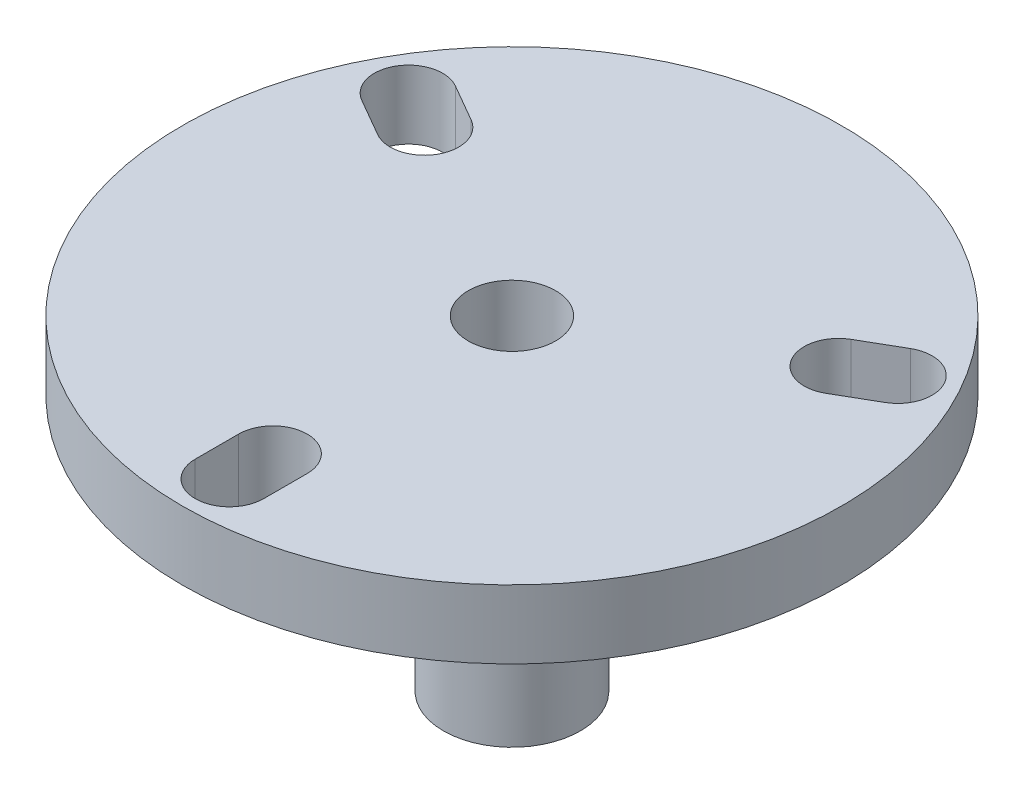
ISO-10303-21;
HEADER;
FILE_DESCRIPTION(('STEP AP214'),'2;1');
FILE_NAME('part.step','',(''),(''),'','','');
FILE_SCHEMA(('AUTOMOTIVE_DESIGN { 1 0 10303 214 1 1 1 1 }'));
ENDSEC;
DATA;
#1=APPLICATION_CONTEXT('core data for automotive mechanical design processes');
#2=APPLICATION_PROTOCOL_DEFINITION('international standard','automotive_design',2000,#1);
#3=PRODUCT_CONTEXT('',#1,'mechanical');
#4=PRODUCT('Part','Part','',(#3));
#5=PRODUCT_RELATED_PRODUCT_CATEGORY('part','',(#4));
#6=PRODUCT_DEFINITION_FORMATION('','',#4);
#7=PRODUCT_DEFINITION_CONTEXT('part definition',#1,'design');
#8=PRODUCT_DEFINITION('design','',#6,#7);
#9=PRODUCT_DEFINITION_SHAPE('','',#8);
#10=(LENGTH_UNIT() NAMED_UNIT(*) SI_UNIT(.MILLI.,.METRE.));
#11=(NAMED_UNIT(*) PLANE_ANGLE_UNIT() SI_UNIT($,.RADIAN.));
#12=(NAMED_UNIT(*) SI_UNIT($,.STERADIAN.) SOLID_ANGLE_UNIT());
#13=UNCERTAINTY_MEASURE_WITH_UNIT(LENGTH_MEASURE(1.E-05),#10,'distance_accuracy_value','');
#14=(GEOMETRIC_REPRESENTATION_CONTEXT(3) GLOBAL_UNCERTAINTY_ASSIGNED_CONTEXT((#13)) GLOBAL_UNIT_ASSIGNED_CONTEXT((#10,
#11,#12)) REPRESENTATION_CONTEXT('',''));
#15=CARTESIAN_POINT('',(0.,0.,0.));
#16=DIRECTION('',(0.,0.,1.));
#17=DIRECTION('',(1.,0.,0.));
#18=AXIS2_PLACEMENT_3D('',#15,#16,#17);
#19=CARTESIAN_POINT('',(0.,-4.,13.96));
#20=DIRECTION('',(0.,1.,0.));
#21=DIRECTION('',(0.,0.,1.));
#22=AXIS2_PLACEMENT_3D('',#19,#20,#21);
#23=CYLINDRICAL_SURFACE('',#22,2.);
#24=CARTESIAN_POINT('',(0.,0.,13.96));
#25=DIRECTION('',(0.,1.,0.));
#26=DIRECTION('',(0.,0.,1.));
#27=AXIS2_PLACEMENT_3D('',#24,#25,#26);
#28=CIRCLE('',#27,2.);
#29=CARTESIAN_POINT('',(2.,0.,13.96));
#30=VERTEX_POINT('',#29);
#31=CARTESIAN_POINT('',(-2.,0.,13.96));
#32=VERTEX_POINT('',#31);
#33=EDGE_CURVE('E180',#30,#32,#28,.T.);
#34=ORIENTED_EDGE('',*,*,#33,.T.);
#35=DIRECTION('',(0.,1.,0.));
#36=VECTOR('',#35,1.);
#37=CARTESIAN_POINT('',(-2.,-4.,13.96));
#38=LINE('',#37,#36);
#39=CARTESIAN_POINT('',(-2.,-4.,13.96));
#40=VERTEX_POINT('',#39);
#41=EDGE_CURVE('E11',#40,#32,#38,.T.);
#42=ORIENTED_EDGE('',*,*,#41,.F.);
#43=CARTESIAN_POINT('',(0.,-4.,13.96));
#44=DIRECTION('',(0.,1.,0.));
#45=DIRECTION('',(0.,0.,1.));
#46=AXIS2_PLACEMENT_3D('',#43,#44,#45);
#47=CIRCLE('',#46,2.);
#48=CARTESIAN_POINT('',(2.,-4.,13.96));
#49=VERTEX_POINT('',#48);
#50=EDGE_CURVE('E54',#49,#40,#47,.T.);
#51=ORIENTED_EDGE('',*,*,#50,.F.);
#52=DIRECTION('',(0.,1.,0.));
#53=VECTOR('',#52,1.);
#54=CARTESIAN_POINT('',(2.,-4.,13.96));
#55=LINE('',#54,#53);
#56=EDGE_CURVE('E146',#49,#30,#55,.T.);
#57=ORIENTED_EDGE('',*,*,#56,.T.);
#58=EDGE_LOOP('',(#34,#42,#51,#57));
#59=FACE_BOUND('',#58,.T.);
#60=ADVANCED_FACE('F35',(#59),#23,.F.);
#61=CARTESIAN_POINT('',(-1.99999999999999,-4.,0.));
#62=DIRECTION('',(1.,0.,0.));
#63=DIRECTION('',(0.,0.,-1.));
#64=AXIS2_PLACEMENT_3D('',#61,#62,#63);
#65=PLANE('',#64);
#66=DIRECTION('',(0.,0.,-1.));
#67=VECTOR('',#66,1.);
#68=CARTESIAN_POINT('',(-1.99999999999999,0.,0.));
#69=LINE('',#68,#67);
#70=CARTESIAN_POINT('',(-2.,0.,16.5));
#71=VERTEX_POINT('',#70);
#72=EDGE_CURVE('E185',#71,#32,#69,.T.);
#73=ORIENTED_EDGE('',*,*,#72,.F.);
#74=DIRECTION('',(0.,1.,0.));
#75=VECTOR('',#74,1.);
#76=CARTESIAN_POINT('',(-2.,-4.,16.5));
#77=LINE('',#76,#75);
#78=CARTESIAN_POINT('',(-2.,-4.,16.5));
#79=VERTEX_POINT('',#78);
#80=EDGE_CURVE('E45',#79,#71,#77,.T.);
#81=ORIENTED_EDGE('',*,*,#80,.F.);
#82=DIRECTION('',(0.,0.,-1.));
#83=VECTOR('',#82,1.);
#84=CARTESIAN_POINT('',(-1.99999999999999,-4.,0.));
#85=LINE('',#84,#83);
#86=EDGE_CURVE('E138',#79,#40,#85,.T.);
#87=ORIENTED_EDGE('',*,*,#86,.T.);
#88=ORIENTED_EDGE('',*,*,#41,.T.);
#89=EDGE_LOOP('',(#73,#81,#87,#88));
#90=FACE_BOUND('',#89,.T.);
#91=ADVANCED_FACE('F285',(#90),#65,.T.);
#92=CARTESIAN_POINT('',(0.,-4.,16.5));
#93=DIRECTION('',(0.,1.,0.));
#94=DIRECTION('',(0.,0.,1.));
#95=AXIS2_PLACEMENT_3D('',#92,#93,#94);
#96=CYLINDRICAL_SURFACE('',#95,2.);
#97=CARTESIAN_POINT('',(0.,0.,16.5));
#98=DIRECTION('',(0.,1.,0.));
#99=DIRECTION('',(0.,0.,1.));
#100=AXIS2_PLACEMENT_3D('',#97,#98,#99);
#101=CIRCLE('',#100,2.);
#102=CARTESIAN_POINT('',(2.,0.,16.5));
#103=VERTEX_POINT('',#102);
#104=EDGE_CURVE('E143',#71,#103,#101,.T.);
#105=ORIENTED_EDGE('',*,*,#104,.T.);
#106=DIRECTION('',(0.,1.,0.));
#107=VECTOR('',#106,1.);
#108=CARTESIAN_POINT('',(2.,-4.,16.5));
#109=LINE('',#108,#107);
#110=CARTESIAN_POINT('',(2.,-4.,16.5));
#111=VERTEX_POINT('',#110);
#112=EDGE_CURVE('E141',#111,#103,#109,.T.);
#113=ORIENTED_EDGE('',*,*,#112,.F.);
#114=CARTESIAN_POINT('',(0.,-4.,16.5));
#115=DIRECTION('',(0.,1.,0.));
#116=DIRECTION('',(0.,0.,1.));
#117=AXIS2_PLACEMENT_3D('',#114,#115,#116);
#118=CIRCLE('',#117,2.);
#119=EDGE_CURVE('E131',#79,#111,#118,.T.);
#120=ORIENTED_EDGE('',*,*,#119,.F.);
#121=ORIENTED_EDGE('',*,*,#80,.T.);
#122=EDGE_LOOP('',(#105,#113,#120,#121));
#123=FACE_BOUND('',#122,.T.);
#124=ADVANCED_FACE('F142',(#123),#96,.F.);
#125=CARTESIAN_POINT('',(0.999999999999998,-4.,1.73205080756888));
#126=DIRECTION('',(0.499999999999998,0.,0.86602540378444));
#127=DIRECTION('',(0.86602540378444,0.,-0.499999999999998));
#128=AXIS2_PLACEMENT_3D('',#125,#126,#127);
#129=PLANE('',#128);
#130=DIRECTION('',(0.86602540378444,0.,-0.499999999999998));
#131=VECTOR('',#130,1.);
#132=CARTESIAN_POINT('',(0.999999999999998,0.,1.73205080756888));
#133=LINE('',#132,#131);
#134=CARTESIAN_POINT('',(13.0897146368308,0.,-5.24794919243109));
#135=VERTEX_POINT('',#134);
#136=CARTESIAN_POINT('',(15.2894191624433,0.,-6.51794919243109));
#137=VERTEX_POINT('',#136);
#138=EDGE_CURVE('E171',#135,#137,#133,.T.);
#139=ORIENTED_EDGE('',*,*,#138,.T.);
#140=DIRECTION('',(0.,1.,0.));
#141=VECTOR('',#140,1.);
#142=CARTESIAN_POINT('',(15.2894191624433,-4.,-6.51794919243109));
#143=LINE('',#142,#141);
#144=CARTESIAN_POINT('',(15.2894191624433,-4.,-6.51794919243109));
#145=VERTEX_POINT('',#144);
#146=EDGE_CURVE('E194',#145,#137,#143,.T.);
#147=ORIENTED_EDGE('',*,*,#146,.F.);
#148=DIRECTION('',(0.86602540378444,0.,-0.499999999999998));
#149=VECTOR('',#148,1.);
#150=CARTESIAN_POINT('',(0.999999999999998,-4.,1.73205080756888));
#151=LINE('',#150,#149);
#152=CARTESIAN_POINT('',(13.0897146368308,-4.,-5.24794919243109));
#153=VERTEX_POINT('',#152);
#154=EDGE_CURVE('E235',#153,#145,#151,.T.);
#155=ORIENTED_EDGE('',*,*,#154,.F.);
#156=DIRECTION('',(0.,1.,0.));
#157=VECTOR('',#156,1.);
#158=CARTESIAN_POINT('',(13.0897146368308,-4.,-5.24794919243109));
#159=LINE('',#158,#157);
#160=EDGE_CURVE('E203',#153,#135,#159,.T.);
#161=ORIENTED_EDGE('',*,*,#160,.T.);
#162=EDGE_LOOP('',(#139,#147,#155,#161));
#163=FACE_BOUND('',#162,.T.);
#164=ADVANCED_FACE('F263',(#163),#129,.F.);
#165=CARTESIAN_POINT('',(14.2894191624433,-4.,-8.24999999999997));
#166=DIRECTION('',(0.,1.,0.));
#167=DIRECTION('',(0.,0.,1.));
#168=AXIS2_PLACEMENT_3D('',#165,#166,#167);
#169=CYLINDRICAL_SURFACE('',#168,2.);
#170=CARTESIAN_POINT('',(14.2894191624433,0.,-8.24999999999997));
#171=DIRECTION('',(0.,1.,0.));
#172=DIRECTION('',(0.,0.,1.));
#173=AXIS2_PLACEMENT_3D('',#170,#171,#172);
#174=CIRCLE('',#173,2.);
#175=CARTESIAN_POINT('',(13.2894191624433,0.,-9.98205080756885));
#176=VERTEX_POINT('',#175);
#177=EDGE_CURVE('E178',#137,#176,#174,.T.);
#178=ORIENTED_EDGE('',*,*,#177,.T.);
#179=DIRECTION('',(0.,1.,0.));
#180=VECTOR('',#179,1.);
#181=CARTESIAN_POINT('',(13.2894191624433,-4.,-9.98205080756885));
#182=LINE('',#181,#180);
#183=CARTESIAN_POINT('',(13.2894191624433,-4.,-9.98205080756885));
#184=VERTEX_POINT('',#183);
#185=EDGE_CURVE('E197',#184,#176,#182,.T.);
#186=ORIENTED_EDGE('',*,*,#185,.F.);
#187=CARTESIAN_POINT('',(14.2894191624433,-4.,-8.24999999999997));
#188=DIRECTION('',(0.,1.,0.));
#189=DIRECTION('',(0.,0.,1.));
#190=AXIS2_PLACEMENT_3D('',#187,#188,#189);
#191=CIRCLE('',#190,2.);
#192=EDGE_CURVE('E151',#145,#184,#191,.T.);
#193=ORIENTED_EDGE('',*,*,#192,.F.);
#194=ORIENTED_EDGE('',*,*,#146,.T.);
#195=EDGE_LOOP('',(#178,#186,#193,#194));
#196=FACE_BOUND('',#195,.T.);
#197=ADVANCED_FACE('F252',(#196),#169,.F.);
#198=CARTESIAN_POINT('',(-0.999999999999994,-4.,-1.73205080756887));
#199=DIRECTION('',(-0.499999999999998,0.,-0.86602540378444));
#200=DIRECTION('',(-0.86602540378444,0.,0.499999999999998));
#201=AXIS2_PLACEMENT_3D('',#198,#199,#200);
#202=PLANE('',#201);
#203=DIRECTION('',(-0.86602540378444,0.,0.499999999999998));
#204=VECTOR('',#203,1.);
#205=CARTESIAN_POINT('',(-0.999999999999994,0.,-1.73205080756887));
#206=LINE('',#205,#204);
#207=CARTESIAN_POINT('',(11.0897146368308,0.,-8.71205080756885));
#208=VERTEX_POINT('',#207);
#209=EDGE_CURVE('E176',#176,#208,#206,.T.);
#210=ORIENTED_EDGE('',*,*,#209,.T.);
#211=DIRECTION('',(0.,1.,0.));
#212=VECTOR('',#211,1.);
#213=CARTESIAN_POINT('',(11.0897146368308,-4.,-8.71205080756885));
#214=LINE('',#213,#212);
#215=CARTESIAN_POINT('',(11.0897146368308,-4.,-8.71205080756885));
#216=VERTEX_POINT('',#215);
#217=EDGE_CURVE('E200',#216,#208,#214,.T.);
#218=ORIENTED_EDGE('',*,*,#217,.F.);
#219=DIRECTION('',(-0.86602540378444,0.,0.499999999999998));
#220=VECTOR('',#219,1.);
#221=CARTESIAN_POINT('',(-0.999999999999994,-4.,-1.73205080756887));
#222=LINE('',#221,#220);
#223=EDGE_CURVE('E244',#184,#216,#222,.T.);
#224=ORIENTED_EDGE('',*,*,#223,.F.);
#225=ORIENTED_EDGE('',*,*,#185,.T.);
#226=EDGE_LOOP('',(#210,#218,#224,#225));
#227=FACE_BOUND('',#226,.T.);
#228=ADVANCED_FACE('F255',(#227),#202,.F.);
#229=CARTESIAN_POINT('',(0.999999999999991,-4.,-1.73205080756887));
#230=DIRECTION('',(-0.499999999999998,0.,0.86602540378444));
#231=DIRECTION('',(0.86602540378444,0.,0.499999999999998));
#232=AXIS2_PLACEMENT_3D('',#229,#230,#231);
#233=PLANE('',#232);
#234=DIRECTION('',(0.86602540378444,0.,0.499999999999998));
#235=VECTOR('',#234,1.);
#236=CARTESIAN_POINT('',(0.999999999999991,0.,-1.73205080756887));
#237=LINE('',#236,#235);
#238=CARTESIAN_POINT('',(-13.2894191624433,0.,-9.98205080756884));
#239=VERTEX_POINT('',#238);
#240=CARTESIAN_POINT('',(-11.0897146368308,0.,-8.71205080756885));
#241=VERTEX_POINT('',#240);
#242=EDGE_CURVE('E160',#239,#241,#237,.T.);
#243=ORIENTED_EDGE('',*,*,#242,.F.);
#244=DIRECTION('',(0.,1.,0.));
#245=VECTOR('',#244,1.);
#246=CARTESIAN_POINT('',(-13.2894191624433,-4.,-9.98205080756884));
#247=LINE('',#246,#245);
#248=CARTESIAN_POINT('',(-13.2894191624433,-4.,-9.98205080756884));
#249=VERTEX_POINT('',#248);
#250=EDGE_CURVE('E206',#249,#239,#247,.T.);
#251=ORIENTED_EDGE('',*,*,#250,.F.);
#252=DIRECTION('',(0.86602540378444,0.,0.499999999999998));
#253=VECTOR('',#252,1.);
#254=CARTESIAN_POINT('',(0.999999999999991,-4.,-1.73205080756887));
#255=LINE('',#254,#253);
#256=CARTESIAN_POINT('',(-11.0897146368308,-4.,-8.71205080756885));
#257=VERTEX_POINT('',#256);
#258=EDGE_CURVE('E190',#249,#257,#255,.T.);
#259=ORIENTED_EDGE('',*,*,#258,.T.);
#260=DIRECTION('',(0.,1.,0.));
#261=VECTOR('',#260,1.);
#262=CARTESIAN_POINT('',(-11.0897146368308,-4.,-8.71205080756885));
#263=LINE('',#262,#261);
#264=EDGE_CURVE('E159',#257,#241,#263,.T.);
#265=ORIENTED_EDGE('',*,*,#264,.T.);
#266=EDGE_LOOP('',(#243,#251,#259,#265));
#267=FACE_BOUND('',#266,.T.);
#268=ADVANCED_FACE('F37',(#267),#233,.T.);
#269=CARTESIAN_POINT('',(-14.2894191624433,-4.,-8.24999999999996));
#270=DIRECTION('',(0.,1.,0.));
#271=DIRECTION('',(0.,0.,1.));
#272=AXIS2_PLACEMENT_3D('',#269,#270,#271);
#273=CYLINDRICAL_SURFACE('',#272,2.00000000000001);
#274=CARTESIAN_POINT('',(-14.2894191624433,0.,-8.24999999999996));
#275=DIRECTION('',(0.,1.,0.));
#276=DIRECTION('',(0.,0.,1.));
#277=AXIS2_PLACEMENT_3D('',#274,#275,#276);
#278=CIRCLE('',#277,2.00000000000001);
#279=CARTESIAN_POINT('',(-15.2894191624433,0.,-6.51794919243108));
#280=VERTEX_POINT('',#279);
#281=EDGE_CURVE('E169',#239,#280,#278,.T.);
#282=ORIENTED_EDGE('',*,*,#281,.T.);
#283=DIRECTION('',(0.,1.,0.));
#284=VECTOR('',#283,1.);
#285=CARTESIAN_POINT('',(-15.2894191624433,-4.,-6.51794919243108));
#286=LINE('',#285,#284);
#287=CARTESIAN_POINT('',(-15.2894191624433,-4.,-6.51794919243108));
#288=VERTEX_POINT('',#287);
#289=EDGE_CURVE('E208',#288,#280,#286,.T.);
#290=ORIENTED_EDGE('',*,*,#289,.F.);
#291=CARTESIAN_POINT('',(-14.2894191624433,-4.,-8.24999999999996));
#292=DIRECTION('',(0.,1.,0.));
#293=DIRECTION('',(0.,0.,1.));
#294=AXIS2_PLACEMENT_3D('',#291,#292,#293);
#295=CIRCLE('',#294,2.00000000000001);
#296=EDGE_CURVE('E233',#249,#288,#295,.T.);
#297=ORIENTED_EDGE('',*,*,#296,.F.);
#298=ORIENTED_EDGE('',*,*,#250,.T.);
#299=EDGE_LOOP('',(#282,#290,#297,#298));
#300=FACE_BOUND('',#299,.T.);
#301=ADVANCED_FACE('F227',(#300),#273,.F.);
#302=CARTESIAN_POINT('',(-0.999999999999999,-4.,1.73205080756888));
#303=DIRECTION('',(-0.499999999999998,0.,0.86602540378444));
#304=DIRECTION('',(0.86602540378444,0.,0.499999999999998));
#305=AXIS2_PLACEMENT_3D('',#302,#303,#304);
#306=PLANE('',#305);
#307=DIRECTION('',(0.86602540378444,0.,0.499999999999998));
#308=VECTOR('',#307,1.);
#309=CARTESIAN_POINT('',(-0.999999999999999,0.,1.73205080756888));
#310=LINE('',#309,#308);
#311=CARTESIAN_POINT('',(-13.0897146368308,0.,-5.24794919243109));
#312=VERTEX_POINT('',#311);
#313=EDGE_CURVE('E167',#280,#312,#310,.T.);
#314=ORIENTED_EDGE('',*,*,#313,.T.);
#315=DIRECTION('',(0.,1.,0.));
#316=VECTOR('',#315,1.);
#317=CARTESIAN_POINT('',(-13.0897146368308,-4.,-5.24794919243109));
#318=LINE('',#317,#316);
#319=CARTESIAN_POINT('',(-13.0897146368308,-4.,-5.24794919243109));
#320=VERTEX_POINT('',#319);
#321=EDGE_CURVE('E211',#320,#312,#318,.T.);
#322=ORIENTED_EDGE('',*,*,#321,.F.);
#323=DIRECTION('',(0.86602540378444,0.,0.499999999999998));
#324=VECTOR('',#323,1.);
#325=CARTESIAN_POINT('',(-0.999999999999999,-4.,1.73205080756888));
#326=LINE('',#325,#324);
#327=EDGE_CURVE('E232',#288,#320,#326,.T.);
#328=ORIENTED_EDGE('',*,*,#327,.F.);
#329=ORIENTED_EDGE('',*,*,#289,.T.);
#330=EDGE_LOOP('',(#314,#322,#328,#329));
#331=FACE_BOUND('',#330,.T.);
#332=ADVANCED_FACE('F231',(#331),#306,.F.);
#333=CARTESIAN_POINT('',(0.,-4.,0.));
#334=DIRECTION('',(0.,1.,0.));
#335=DIRECTION('',(0.,0.,1.));
#336=AXIS2_PLACEMENT_3D('',#333,#334,#335);
#337=CYLINDRICAL_SURFACE('',#336,19.25);
#338=CARTESIAN_POINT('',(0.,-4.,0.));
#339=DIRECTION('',(0.,1.,0.));
#340=DIRECTION('',(0.,0.,1.));
#341=AXIS2_PLACEMENT_3D('',#338,#339,#340);
#342=CIRCLE('',#341,19.25);
#343=CARTESIAN_POINT('',(0.,-4.,19.25));
#344=VERTEX_POINT('',#343);
#345=EDGE_CURVE('E156',#344,#344,#342,.T.);
#346=ORIENTED_EDGE('',*,*,#345,.T.);
#347=EDGE_LOOP('',(#346));
#348=FACE_BOUND('',#347,.T.);
#349=CARTESIAN_POINT('',(0.,0.,0.));
#350=DIRECTION('',(0.,1.,0.));
#351=DIRECTION('',(0.,0.,1.));
#352=AXIS2_PLACEMENT_3D('',#349,#350,#351);
#353=CIRCLE('',#352,19.25);
#354=CARTESIAN_POINT('',(0.,0.,19.25));
#355=VERTEX_POINT('',#354);
#356=EDGE_CURVE('E188',#355,#355,#353,.T.);
#357=ORIENTED_EDGE('',*,*,#356,.F.);
#358=EDGE_LOOP('',(#357));
#359=FACE_BOUND('',#358,.T.);
#360=ADVANCED_FACE('F273',(#348,#359),#337,.T.);
#361=CARTESIAN_POINT('',(1.99999999999999,-4.,0.));
#362=DIRECTION('',(1.,0.,0.));
#363=DIRECTION('',(0.,0.,-1.));
#364=AXIS2_PLACEMENT_3D('',#361,#362,#363);
#365=PLANE('',#364);
#366=DIRECTION('',(0.,0.,-1.));
#367=VECTOR('',#366,1.);
#368=CARTESIAN_POINT('',(1.99999999999999,0.,0.));
#369=LINE('',#368,#367);
#370=EDGE_CURVE('E182',#103,#30,#369,.T.);
#371=ORIENTED_EDGE('',*,*,#370,.T.);
#372=ORIENTED_EDGE('',*,*,#56,.F.);
#373=DIRECTION('',(0.,0.,-1.));
#374=VECTOR('',#373,1.);
#375=CARTESIAN_POINT('',(1.99999999999999,-4.,0.));
#376=LINE('',#375,#374);
#377=EDGE_CURVE('E136',#111,#49,#376,.T.);
#378=ORIENTED_EDGE('',*,*,#377,.F.);
#379=ORIENTED_EDGE('',*,*,#112,.T.);
#380=EDGE_LOOP('',(#371,#372,#378,#379));
#381=FACE_BOUND('',#380,.T.);
#382=ADVANCED_FACE('F148',(#381),#365,.F.);
#383=CARTESIAN_POINT('',(12.0897146368308,-4.,-6.97999999999997));
#384=DIRECTION('',(0.,1.,0.));
#385=DIRECTION('',(0.,0.,1.));
#386=AXIS2_PLACEMENT_3D('',#383,#384,#385);
#387=CYLINDRICAL_SURFACE('',#386,2.);
#388=CARTESIAN_POINT('',(12.0897146368308,0.,-6.97999999999997));
#389=DIRECTION('',(0.,1.,0.));
#390=DIRECTION('',(0.,0.,1.));
#391=AXIS2_PLACEMENT_3D('',#388,#389,#390);
#392=CIRCLE('',#391,2.);
#393=EDGE_CURVE('E174',#208,#135,#392,.T.);
#394=ORIENTED_EDGE('',*,*,#393,.T.);
#395=ORIENTED_EDGE('',*,*,#160,.F.);
#396=CARTESIAN_POINT('',(12.0897146368308,-4.,-6.97999999999997));
#397=DIRECTION('',(0.,1.,0.));
#398=DIRECTION('',(0.,0.,1.));
#399=AXIS2_PLACEMENT_3D('',#396,#397,#398);
#400=CIRCLE('',#399,2.);
#401=EDGE_CURVE('E242',#216,#153,#400,.T.);
#402=ORIENTED_EDGE('',*,*,#401,.F.);
#403=ORIENTED_EDGE('',*,*,#217,.T.);
#404=EDGE_LOOP('',(#394,#395,#402,#403));
#405=FACE_BOUND('',#404,.T.);
#406=ADVANCED_FACE('F260',(#405),#387,.F.);
#407=CARTESIAN_POINT('',(-12.0897146368308,-4.,-6.97999999999997));
#408=DIRECTION('',(0.,1.,0.));
#409=DIRECTION('',(0.,0.,1.));
#410=AXIS2_PLACEMENT_3D('',#407,#408,#409);
#411=CYLINDRICAL_SURFACE('',#410,2.00000000000001);
#412=CARTESIAN_POINT('',(-12.0897146368308,0.,-6.97999999999997));
#413=DIRECTION('',(0.,1.,0.));
#414=DIRECTION('',(0.,0.,1.));
#415=AXIS2_PLACEMENT_3D('',#412,#413,#414);
#416=CIRCLE('',#415,2.00000000000001);
#417=EDGE_CURVE('E163',#312,#241,#416,.T.);
#418=ORIENTED_EDGE('',*,*,#417,.T.);
#419=ORIENTED_EDGE('',*,*,#264,.F.);
#420=CARTESIAN_POINT('',(-12.0897146368308,-4.,-6.97999999999997));
#421=DIRECTION('',(0.,1.,0.));
#422=DIRECTION('',(0.,0.,1.));
#423=AXIS2_PLACEMENT_3D('',#420,#421,#422);
#424=CIRCLE('',#423,2.00000000000001);
#425=EDGE_CURVE('E107',#320,#257,#424,.T.);
#426=ORIENTED_EDGE('',*,*,#425,.F.);
#427=ORIENTED_EDGE('',*,*,#321,.T.);
#428=EDGE_LOOP('',(#418,#419,#426,#427));
#429=FACE_BOUND('',#428,.T.);
#430=ADVANCED_FACE('F218',(#429),#411,.F.);
#431=CARTESIAN_POINT('',(0.,-4.,0.));
#432=DIRECTION('',(0.,1.,0.));
#433=DIRECTION('',(0.,0.,1.));
#434=AXIS2_PLACEMENT_3D('',#431,#432,#433);
#435=PLANE('',#434);
#436=ORIENTED_EDGE('',*,*,#258,.F.);
#437=ORIENTED_EDGE('',*,*,#296,.T.);
#438=ORIENTED_EDGE('',*,*,#327,.T.);
#439=ORIENTED_EDGE('',*,*,#425,.T.);
#440=EDGE_LOOP('',(#436,#437,#438,#439));
#441=FACE_BOUND('',#440,.T.);
#442=ORIENTED_EDGE('',*,*,#154,.T.);
#443=ORIENTED_EDGE('',*,*,#192,.T.);
#444=ORIENTED_EDGE('',*,*,#223,.T.);
#445=ORIENTED_EDGE('',*,*,#401,.T.);
#446=EDGE_LOOP('',(#442,#443,#444,#445));
#447=FACE_BOUND('',#446,.T.);
#448=ORIENTED_EDGE('',*,*,#50,.T.);
#449=ORIENTED_EDGE('',*,*,#86,.F.);
#450=ORIENTED_EDGE('',*,*,#119,.T.);
#451=ORIENTED_EDGE('',*,*,#377,.T.);
#452=EDGE_LOOP('',(#448,#449,#450,#451));
#453=FACE_BOUND('',#452,.T.);
#454=ORIENTED_EDGE('',*,*,#345,.F.);
#455=EDGE_LOOP('',(#454));
#456=FACE_BOUND('',#455,.T.);
#457=CARTESIAN_POINT('',(0.,-4.,0.));
#458=DIRECTION('',(0.,1.,0.));
#459=DIRECTION('',(0.,0.,1.));
#460=AXIS2_PLACEMENT_3D('',#457,#458,#459);
#461=CIRCLE('',#460,4.);
#462=CARTESIAN_POINT('',(0.,-4.,4.));
#463=VERTEX_POINT('',#462);
#464=EDGE_CURVE('E164',#463,#463,#461,.T.);
#465=ORIENTED_EDGE('',*,*,#464,.T.);
#466=EDGE_LOOP('',(#465));
#467=FACE_BOUND('',#466,.T.);
#468=ADVANCED_FACE('F133',(#441,#447,#453,#456,#467),#435,.F.);
#469=CARTESIAN_POINT('',(0.,0.,0.));
#470=DIRECTION('',(0.,1.,0.));
#471=DIRECTION('',(0.,0.,1.));
#472=AXIS2_PLACEMENT_3D('',#469,#470,#471);
#473=PLANE('',#472);
#474=CARTESIAN_POINT('',(0.,0.,0.));
#475=DIRECTION('',(0.,1.,0.));
#476=DIRECTION('',(0.,0.,1.));
#477=AXIS2_PLACEMENT_3D('',#474,#475,#476);
#478=CIRCLE('',#477,2.55);
#479=CARTESIAN_POINT('',(0.,0.,2.55));
#480=VERTEX_POINT('',#479);
#481=EDGE_CURVE('E341',#480,#480,#478,.T.);
#482=ORIENTED_EDGE('',*,*,#481,.F.);
#483=EDGE_LOOP('',(#482));
#484=FACE_BOUND('',#483,.T.);
#485=ORIENTED_EDGE('',*,*,#242,.T.);
#486=ORIENTED_EDGE('',*,*,#417,.F.);
#487=ORIENTED_EDGE('',*,*,#313,.F.);
#488=ORIENTED_EDGE('',*,*,#281,.F.);
#489=EDGE_LOOP('',(#485,#486,#487,#488));
#490=FACE_BOUND('',#489,.T.);
#491=ORIENTED_EDGE('',*,*,#138,.F.);
#492=ORIENTED_EDGE('',*,*,#393,.F.);
#493=ORIENTED_EDGE('',*,*,#209,.F.);
#494=ORIENTED_EDGE('',*,*,#177,.F.);
#495=EDGE_LOOP('',(#491,#492,#493,#494));
#496=FACE_BOUND('',#495,.T.);
#497=ORIENTED_EDGE('',*,*,#33,.F.);
#498=ORIENTED_EDGE('',*,*,#370,.F.);
#499=ORIENTED_EDGE('',*,*,#104,.F.);
#500=ORIENTED_EDGE('',*,*,#72,.T.);
#501=EDGE_LOOP('',(#497,#498,#499,#500));
#502=FACE_BOUND('',#501,.T.);
#503=ORIENTED_EDGE('',*,*,#356,.T.);
#504=EDGE_LOOP('',(#503));
#505=FACE_BOUND('',#504,.T.);
#506=ADVANCED_FACE('F223',(#484,#490,#496,#502,#505),#473,.T.);
#507=CARTESIAN_POINT('',(0.,-19.,0.));
#508=DIRECTION('',(0.,1.,0.));
#509=DIRECTION('',(0.,0.,1.));
#510=AXIS2_PLACEMENT_3D('',#507,#508,#509);
#511=CYLINDRICAL_SURFACE('',#510,4.);
#512=CARTESIAN_POINT('',(0.,-19.,0.));
#513=DIRECTION('',(0.,1.,0.));
#514=DIRECTION('',(0.,0.,1.));
#515=AXIS2_PLACEMENT_3D('',#512,#513,#514);
#516=CIRCLE('',#515,4.);
#517=CARTESIAN_POINT('',(0.,-19.,4.));
#518=VERTEX_POINT('',#517);
#519=EDGE_CURVE('E353',#518,#518,#516,.T.);
#520=ORIENTED_EDGE('',*,*,#519,.T.);
#521=EDGE_LOOP('',(#520));
#522=FACE_BOUND('',#521,.T.);
#523=ORIENTED_EDGE('',*,*,#464,.F.);
#524=EDGE_LOOP('',(#523));
#525=FACE_BOUND('',#524,.T.);
#526=ADVANCED_FACE('F266',(#522,#525),#511,.T.);
#527=CARTESIAN_POINT('',(0.,-19.,0.));
#528=DIRECTION('',(0.,1.,0.));
#529=DIRECTION('',(0.,0.,1.));
#530=AXIS2_PLACEMENT_3D('',#527,#528,#529);
#531=PLANE('',#530);
#532=CARTESIAN_POINT('',(0.,-19.,0.));
#533=DIRECTION('',(0.,1.,0.));
#534=DIRECTION('',(0.,0.,1.));
#535=AXIS2_PLACEMENT_3D('',#532,#533,#534);
#536=CIRCLE('',#535,0.8);
#537=CARTESIAN_POINT('',(0.,-19.,0.8));
#538=VERTEX_POINT('',#537);
#539=EDGE_CURVE('E343',#538,#538,#536,.T.);
#540=ORIENTED_EDGE('',*,*,#539,.T.);
#541=EDGE_LOOP('',(#540));
#542=FACE_BOUND('',#541,.T.);
#543=ORIENTED_EDGE('',*,*,#519,.F.);
#544=EDGE_LOOP('',(#543));
#545=FACE_BOUND('',#544,.T.);
#546=ADVANCED_FACE('F312',(#542,#545),#531,.F.);
#547=CARTESIAN_POINT('',(0.,0.,0.));
#548=DIRECTION('',(0.,1.,0.));
#549=DIRECTION('',(0.,0.,1.));
#550=AXIS2_PLACEMENT_3D('',#547,#548,#549);
#551=CYLINDRICAL_SURFACE('',#550,0.8);
#552=CARTESIAN_POINT('',(0.,-17.,0.));
#553=DIRECTION('',(0.,1.,0.));
#554=DIRECTION('',(0.,0.,1.));
#555=AXIS2_PLACEMENT_3D('',#552,#553,#554);
#556=CIRCLE('',#555,0.8);
#557=CARTESIAN_POINT('',(0.,-17.,0.8));
#558=VERTEX_POINT('',#557);
#559=EDGE_CURVE('E340',#558,#558,#556,.T.);
#560=ORIENTED_EDGE('',*,*,#559,.T.);
#561=EDGE_LOOP('',(#560));
#562=FACE_BOUND('',#561,.T.);
#563=ORIENTED_EDGE('',*,*,#539,.F.);
#564=EDGE_LOOP('',(#563));
#565=FACE_BOUND('',#564,.T.);
#566=ADVANCED_FACE('F316',(#562,#565),#551,.F.);
#567=CARTESIAN_POINT('',(0.,0.,0.));
#568=DIRECTION('',(0.,1.,0.));
#569=DIRECTION('',(0.,0.,1.));
#570=AXIS2_PLACEMENT_3D('',#567,#568,#569);
#571=CONICAL_SURFACE('',#570,1.,0.0117641631497587);
#572=CARTESIAN_POINT('',(0.,-6.46657299740787,0.));
#573=DIRECTION('',(0.,1.,0.));
#574=DIRECTION('',(0.,0.,1.));
#575=AXIS2_PLACEMENT_3D('',#572,#573,#574);
#576=CIRCLE('',#575,0.923922670618731);
#577=CARTESIAN_POINT('',(0.,-6.46657299740787,0.923922670618731));
#578=VERTEX_POINT('',#577);
#579=EDGE_CURVE('E39',#578,#578,#576,.T.);
#580=ORIENTED_EDGE('',*,*,#579,.T.);
#581=EDGE_LOOP('',(#580));
#582=FACE_BOUND('',#581,.T.);
#583=ORIENTED_EDGE('',*,*,#559,.F.);
#584=EDGE_LOOP('',(#583));
#585=FACE_BOUND('',#584,.T.);
#586=ADVANCED_FACE('F320',(#582,#585),#571,.F.);
#587=CARTESIAN_POINT('',(0.,-5.52775681356644,0.));
#588=DIRECTION('',(0.,1.,0.));
#589=DIRECTION('',(0.,0.,1.));
#590=AXIS2_PLACEMENT_3D('',#587,#588,#589);
#591=CONICAL_SURFACE('',#590,2.55,1.04719755119659);
#592=CARTESIAN_POINT('',(0.,-5.52775681356644,0.));
#593=DIRECTION('',(0.,1.,0.));
#594=DIRECTION('',(0.,0.,1.));
#595=AXIS2_PLACEMENT_3D('',#592,#593,#594);
#596=CIRCLE('',#595,2.55);
#597=CARTESIAN_POINT('',(0.,-5.52775681356644,2.55));
#598=VERTEX_POINT('',#597);
#599=EDGE_CURVE('E337',#598,#598,#596,.T.);
#600=ORIENTED_EDGE('',*,*,#599,.T.);
#601=EDGE_LOOP('',(#600));
#602=FACE_BOUND('',#601,.T.);
#603=ORIENTED_EDGE('',*,*,#579,.F.);
#604=EDGE_LOOP('',(#603));
#605=FACE_BOUND('',#604,.T.);
#606=ADVANCED_FACE('F324',(#602,#605),#591,.F.);
#607=CARTESIAN_POINT('',(0.,0.,0.));
#608=DIRECTION('',(0.,1.,0.));
#609=DIRECTION('',(0.,0.,1.));
#610=AXIS2_PLACEMENT_3D('',#607,#608,#609);
#611=CYLINDRICAL_SURFACE('',#610,2.55);
#612=ORIENTED_EDGE('',*,*,#599,.F.);
#613=EDGE_LOOP('',(#612));
#614=FACE_BOUND('',#613,.T.);
#615=ORIENTED_EDGE('',*,*,#481,.T.);
#616=EDGE_LOOP('',(#615));
#617=FACE_BOUND('',#616,.T.);
#618=ADVANCED_FACE('F326',(#614,#617),#611,.F.);
#619=CLOSED_SHELL('',(#60,#91,#124,#164,#197,#228,#268,#301,#332,#360,#382,#406,#430,#468,#506,
#526,#546,#566,#586,#606,#618));
#620=MANIFOLD_SOLID_BREP('B2',#619);
#621=ADVANCED_BREP_SHAPE_REPRESENTATION('',(#18,#620),#14);
#622=SHAPE_DEFINITION_REPRESENTATION(#9,#621);
ENDSEC;
END-ISO-10303-21;
